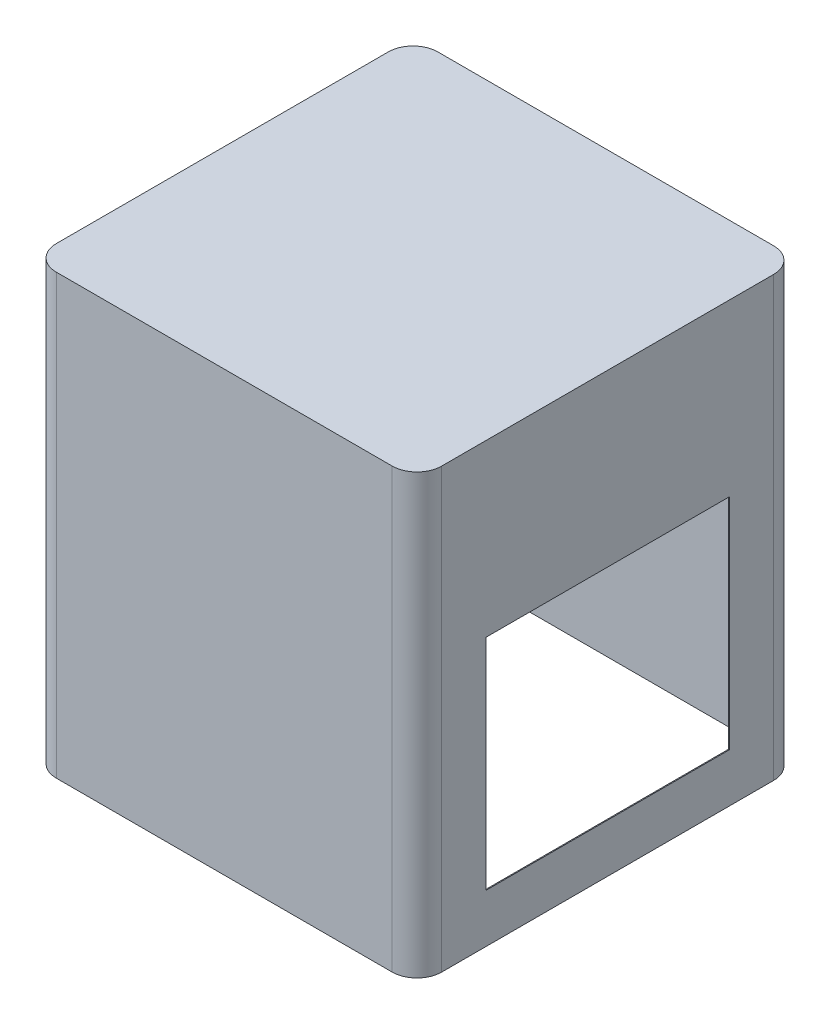
ISO-10303-21;
HEADER;
FILE_DESCRIPTION(('STEP AP214'),'2;1');
FILE_NAME('part.step','',(''),(''),'','','');
FILE_SCHEMA(('AUTOMOTIVE_DESIGN { 1 0 10303 214 1 1 1 1 }'));
ENDSEC;
DATA;
#1=APPLICATION_CONTEXT('core data for automotive mechanical design processes');
#2=APPLICATION_PROTOCOL_DEFINITION('international standard','automotive_design',2000,#1);
#3=PRODUCT_CONTEXT('',#1,'mechanical');
#4=PRODUCT('Part','Part','',(#3));
#5=PRODUCT_RELATED_PRODUCT_CATEGORY('part','',(#4));
#6=PRODUCT_DEFINITION_FORMATION('','',#4);
#7=PRODUCT_DEFINITION_CONTEXT('part definition',#1,'design');
#8=PRODUCT_DEFINITION('design','',#6,#7);
#9=PRODUCT_DEFINITION_SHAPE('','',#8);
#10=(LENGTH_UNIT() NAMED_UNIT(*) SI_UNIT(.MILLI.,.METRE.));
#11=(NAMED_UNIT(*) PLANE_ANGLE_UNIT() SI_UNIT($,.RADIAN.));
#12=(NAMED_UNIT(*) SI_UNIT($,.STERADIAN.) SOLID_ANGLE_UNIT());
#13=UNCERTAINTY_MEASURE_WITH_UNIT(LENGTH_MEASURE(1.E-05),#10,'distance_accuracy_value','');
#14=(GEOMETRIC_REPRESENTATION_CONTEXT(3) GLOBAL_UNCERTAINTY_ASSIGNED_CONTEXT((#13)) GLOBAL_UNIT_ASSIGNED_CONTEXT((#10,
#11,#12)) REPRESENTATION_CONTEXT('',''));
#15=CARTESIAN_POINT('',(0.,0.,0.));
#16=DIRECTION('',(0.,0.,1.));
#17=DIRECTION('',(1.,0.,0.));
#18=AXIS2_PLACEMENT_3D('',#15,#16,#17);
#19=CARTESIAN_POINT('',(197.85242,450.,-195.85242));
#20=DIRECTION('',(-1.,0.,0.));
#21=DIRECTION('',(0.,0.,1.));
#22=AXIS2_PLACEMENT_3D('',#19,#20,#21);
#23=PLANE('',#22);
#24=DIRECTION('',(0.,0.,-1.));
#25=VECTOR('',#24,1.);
#26=CARTESIAN_POINT('',(197.85242,0.,-195.85242));
#27=LINE('',#26,#25);
#28=CARTESIAN_POINT('',(197.85242,0.,170.45242));
#29=VERTEX_POINT('',#28);
#30=CARTESIAN_POINT('',(197.85242,0.,-170.45242));
#31=VERTEX_POINT('',#30);
#32=EDGE_CURVE('E300',#29,#31,#27,.T.);
#33=ORIENTED_EDGE('',*,*,#32,.T.);
#34=DIRECTION('',(0.,-1.,0.));
#35=VECTOR('',#34,1.);
#36=CARTESIAN_POINT('',(197.85242,450.,-170.45242));
#37=LINE('',#36,#35);
#38=CARTESIAN_POINT('',(197.85242,450.,-170.45242));
#39=VERTEX_POINT('',#38);
#40=EDGE_CURVE('E323',#31,#39,#37,.F.);
#41=ORIENTED_EDGE('',*,*,#40,.T.);
#42=DIRECTION('',(0.,0.,-1.));
#43=VECTOR('',#42,1.);
#44=CARTESIAN_POINT('',(197.85242,450.,-195.85242));
#45=LINE('',#44,#43);
#46=CARTESIAN_POINT('',(197.85242,450.,170.45242));
#47=VERTEX_POINT('',#46);
#48=EDGE_CURVE('E287',#47,#39,#45,.T.);
#49=ORIENTED_EDGE('',*,*,#48,.F.);
#50=DIRECTION('',(0.,-1.,0.));
#51=VECTOR('',#50,1.);
#52=CARTESIAN_POINT('',(197.85242,450.,170.45242));
#53=LINE('',#52,#51);
#54=EDGE_CURVE('E320',#47,#29,#53,.T.);
#55=ORIENTED_EDGE('',*,*,#54,.T.);
#56=EDGE_LOOP('',(#33,#41,#49,#55));
#57=FACE_BOUND('',#56,.T.);
#58=DIRECTION('',(0.,0.,-1.));
#59=VECTOR('',#58,1.);
#60=CARTESIAN_POINT('',(197.85242,275.,-125.));
#61=LINE('',#60,#59);
#62=CARTESIAN_POINT('',(197.85242,275.,125.));
#63=VERTEX_POINT('',#62);
#64=CARTESIAN_POINT('',(197.85242,275.,-125.));
#65=VERTEX_POINT('',#64);
#66=EDGE_CURVE('E211',#63,#65,#61,.T.);
#67=ORIENTED_EDGE('',*,*,#66,.T.);
#68=DIRECTION('',(0.,-1.,0.));
#69=VECTOR('',#68,1.);
#70=CARTESIAN_POINT('',(197.85242,275.,-125.));
#71=LINE('',#70,#69);
#72=CARTESIAN_POINT('',(197.85242,50.,-125.));
#73=VERTEX_POINT('',#72);
#74=EDGE_CURVE('E214',#65,#73,#71,.T.);
#75=ORIENTED_EDGE('',*,*,#74,.T.);
#76=DIRECTION('',(0.,0.,1.));
#77=VECTOR('',#76,1.);
#78=CARTESIAN_POINT('',(197.85242,50.,-125.));
#79=LINE('',#78,#77);
#80=CARTESIAN_POINT('',(197.85242,50.,125.));
#81=VERTEX_POINT('',#80);
#82=EDGE_CURVE('E58',#73,#81,#79,.T.);
#83=ORIENTED_EDGE('',*,*,#82,.T.);
#84=DIRECTION('',(0.,1.,0.));
#85=VECTOR('',#84,1.);
#86=CARTESIAN_POINT('',(197.85242,275.,125.));
#87=LINE('',#86,#85);
#88=EDGE_CURVE('E188',#81,#63,#87,.T.);
#89=ORIENTED_EDGE('',*,*,#88,.T.);
#90=EDGE_LOOP('',(#67,#75,#83,#89));
#91=FACE_BOUND('',#90,.T.);
#92=ADVANCED_FACE('F40',(#57,#91),#23,.F.);
#93=CARTESIAN_POINT('',(196.89992,450.,-195.85242));
#94=DIRECTION('',(-1.,0.,0.));
#95=DIRECTION('',(0.,0.,1.));
#96=AXIS2_PLACEMENT_3D('',#93,#94,#95);
#97=PLANE('',#96);
#98=DIRECTION('',(0.,0.,-1.));
#99=VECTOR('',#98,1.);
#100=CARTESIAN_POINT('',(196.89992,0.,0.));
#101=LINE('',#100,#99);
#102=CARTESIAN_POINT('',(196.89992,0.,170.45242));
#103=VERTEX_POINT('',#102);
#104=CARTESIAN_POINT('',(196.89992,0.,-170.45242));
#105=VERTEX_POINT('',#104);
#106=EDGE_CURVE('E271',#103,#105,#101,.T.);
#107=ORIENTED_EDGE('',*,*,#106,.F.);
#108=DIRECTION('',(0.,1.,0.));
#109=VECTOR('',#108,1.);
#110=CARTESIAN_POINT('',(196.89992,450.,170.45242));
#111=LINE('',#110,#109);
#112=CARTESIAN_POINT('',(196.89992,449.0475,170.45242));
#113=VERTEX_POINT('',#112);
#114=EDGE_CURVE('E250',#113,#103,#111,.F.);
#115=ORIENTED_EDGE('',*,*,#114,.F.);
#116=DIRECTION('',(0.,0.,-1.));
#117=VECTOR('',#116,1.);
#118=CARTESIAN_POINT('',(196.89992,449.0475,0.));
#119=LINE('',#118,#117);
#120=CARTESIAN_POINT('',(196.89992,449.0475,-170.45242));
#121=VERTEX_POINT('',#120);
#122=EDGE_CURVE('E228',#113,#121,#119,.T.);
#123=ORIENTED_EDGE('',*,*,#122,.T.);
#124=DIRECTION('',(0.,1.,0.));
#125=VECTOR('',#124,1.);
#126=CARTESIAN_POINT('',(196.89992,450.,-170.45242));
#127=LINE('',#126,#125);
#128=EDGE_CURVE('E244',#105,#121,#127,.T.);
#129=ORIENTED_EDGE('',*,*,#128,.F.);
#130=EDGE_LOOP('',(#107,#115,#123,#129));
#131=FACE_BOUND('',#130,.T.);
#132=DIRECTION('',(0.,-1.,0.));
#133=VECTOR('',#132,1.);
#134=CARTESIAN_POINT('',(196.89992,275.,-125.));
#135=LINE('',#134,#133);
#136=CARTESIAN_POINT('',(196.89992,275.,-125.));
#137=VERTEX_POINT('',#136);
#138=CARTESIAN_POINT('',(196.89992,50.,-125.));
#139=VERTEX_POINT('',#138);
#140=EDGE_CURVE('E191',#137,#139,#135,.T.);
#141=ORIENTED_EDGE('',*,*,#140,.F.);
#142=DIRECTION('',(0.,0.,-1.));
#143=VECTOR('',#142,1.);
#144=CARTESIAN_POINT('',(196.89992,275.,-125.));
#145=LINE('',#144,#143);
#146=CARTESIAN_POINT('',(196.89992,275.,125.));
#147=VERTEX_POINT('',#146);
#148=EDGE_CURVE('E66',#147,#137,#145,.T.);
#149=ORIENTED_EDGE('',*,*,#148,.F.);
#150=DIRECTION('',(0.,1.,0.));
#151=VECTOR('',#150,1.);
#152=CARTESIAN_POINT('',(196.89992,275.,125.));
#153=LINE('',#152,#151);
#154=CARTESIAN_POINT('',(196.89992,50.,125.));
#155=VERTEX_POINT('',#154);
#156=EDGE_CURVE('E199',#155,#147,#153,.T.);
#157=ORIENTED_EDGE('',*,*,#156,.F.);
#158=DIRECTION('',(0.,0.,1.));
#159=VECTOR('',#158,1.);
#160=CARTESIAN_POINT('',(196.89992,50.,-125.));
#161=LINE('',#160,#159);
#162=EDGE_CURVE('E182',#139,#155,#161,.T.);
#163=ORIENTED_EDGE('',*,*,#162,.F.);
#164=EDGE_LOOP('',(#141,#149,#157,#163));
#165=FACE_BOUND('',#164,.T.);
#166=ADVANCED_FACE('F197',(#131,#165),#97,.T.);
#167=CARTESIAN_POINT('',(0.,0.,0.));
#168=DIRECTION('',(0.,-1.,0.));
#169=DIRECTION('',(0.,0.,-1.));
#170=AXIS2_PLACEMENT_3D('',#167,#168,#169);
#171=PLANE('',#170);
#172=DIRECTION('',(-1.,0.,0.));
#173=VECTOR('',#172,1.);
#174=CARTESIAN_POINT('',(197.85242,0.,-195.85242));
#175=LINE('',#174,#173);
#176=CARTESIAN_POINT('',(172.45242,0.,-195.85242));
#177=VERTEX_POINT('',#176);
#178=CARTESIAN_POINT('',(-172.45242,0.,-195.85242));
#179=VERTEX_POINT('',#178);
#180=EDGE_CURVE('E284',#177,#179,#175,.T.);
#181=ORIENTED_EDGE('',*,*,#180,.F.);
#182=CARTESIAN_POINT('',(172.45242,0.,-170.45242));
#183=DIRECTION('',(0.,-1.,0.));
#184=DIRECTION('',(0.,0.,-1.));
#185=AXIS2_PLACEMENT_3D('',#182,#183,#184);
#186=CIRCLE('',#185,25.4);
#187=EDGE_CURVE('E318',#177,#31,#186,.T.);
#188=ORIENTED_EDGE('',*,*,#187,.T.);
#189=ORIENTED_EDGE('',*,*,#32,.F.);
#190=CARTESIAN_POINT('',(172.45242,0.,170.45242));
#191=DIRECTION('',(0.,-1.,0.));
#192=DIRECTION('',(0.,0.,-1.));
#193=AXIS2_PLACEMENT_3D('',#190,#191,#192);
#194=CIRCLE('',#193,25.4);
#195=CARTESIAN_POINT('',(172.45242,0.,195.85242));
#196=VERTEX_POINT('',#195);
#197=EDGE_CURVE('E312',#29,#196,#194,.T.);
#198=ORIENTED_EDGE('',*,*,#197,.T.);
#199=DIRECTION('',(1.,0.,0.));
#200=VECTOR('',#199,1.);
#201=CARTESIAN_POINT('',(197.85242,0.,195.85242));
#202=LINE('',#201,#200);
#203=CARTESIAN_POINT('',(-172.45242,0.,195.85242));
#204=VERTEX_POINT('',#203);
#205=EDGE_CURVE('E297',#204,#196,#202,.T.);
#206=ORIENTED_EDGE('',*,*,#205,.F.);
#207=CARTESIAN_POINT('',(-172.45242,0.,170.45242));
#208=DIRECTION('',(0.,-1.,0.));
#209=DIRECTION('',(0.,0.,-1.));
#210=AXIS2_PLACEMENT_3D('',#207,#208,#209);
#211=CIRCLE('',#210,25.4);
#212=CARTESIAN_POINT('',(-197.85242,0.,170.45242));
#213=VERTEX_POINT('',#212);
#214=EDGE_CURVE('E314',#204,#213,#211,.T.);
#215=ORIENTED_EDGE('',*,*,#214,.T.);
#216=DIRECTION('',(0.,0.,1.));
#217=VECTOR('',#216,1.);
#218=CARTESIAN_POINT('',(-197.85242,0.,-195.85242));
#219=LINE('',#218,#217);
#220=CARTESIAN_POINT('',(-197.85242,0.,-170.45242));
#221=VERTEX_POINT('',#220);
#222=EDGE_CURVE('E248',#221,#213,#219,.T.);
#223=ORIENTED_EDGE('',*,*,#222,.F.);
#224=CARTESIAN_POINT('',(-172.45242,0.,-170.45242));
#225=DIRECTION('',(0.,-1.,0.));
#226=DIRECTION('',(0.,0.,-1.));
#227=AXIS2_PLACEMENT_3D('',#224,#225,#226);
#228=CIRCLE('',#227,25.4);
#229=EDGE_CURVE('E316',#221,#179,#228,.T.);
#230=ORIENTED_EDGE('',*,*,#229,.T.);
#231=EDGE_LOOP('',(#181,#188,#189,#198,#206,#215,#223,#230));
#232=FACE_BOUND('',#231,.T.);
#233=CARTESIAN_POINT('',(172.45242,0.,-170.45242));
#234=DIRECTION('',(0.,-1.,0.));
#235=DIRECTION('',(0.,0.,-1.));
#236=AXIS2_PLACEMENT_3D('',#233,#234,#235);
#237=CIRCLE('',#236,24.4475);
#238=CARTESIAN_POINT('',(172.45242,0.,-194.89992));
#239=VERTEX_POINT('',#238);
#240=EDGE_CURVE('E252',#239,#105,#237,.T.);
#241=ORIENTED_EDGE('',*,*,#240,.F.);
#242=DIRECTION('',(-1.,0.,0.));
#243=VECTOR('',#242,1.);
#244=CARTESIAN_POINT('',(0.,0.,-194.89992));
#245=LINE('',#244,#243);
#246=CARTESIAN_POINT('',(-172.45242,0.,-194.89992));
#247=VERTEX_POINT('',#246);
#248=EDGE_CURVE('E219',#239,#247,#245,.T.);
#249=ORIENTED_EDGE('',*,*,#248,.T.);
#250=CARTESIAN_POINT('',(-172.45242,0.,-170.45242));
#251=DIRECTION('',(0.,-1.,0.));
#252=DIRECTION('',(0.,0.,-1.));
#253=AXIS2_PLACEMENT_3D('',#250,#251,#252);
#254=CIRCLE('',#253,24.4475);
#255=CARTESIAN_POINT('',(-196.89992,0.,-170.45242));
#256=VERTEX_POINT('',#255);
#257=EDGE_CURVE('E265',#256,#247,#254,.T.);
#258=ORIENTED_EDGE('',*,*,#257,.F.);
#259=DIRECTION('',(0.,0.,1.));
#260=VECTOR('',#259,1.);
#261=CARTESIAN_POINT('',(-196.89992,0.,0.));
#262=LINE('',#261,#260);
#263=CARTESIAN_POINT('',(-196.89992,0.,170.45242));
#264=VERTEX_POINT('',#263);
#265=EDGE_CURVE('E260',#256,#264,#262,.T.);
#266=ORIENTED_EDGE('',*,*,#265,.T.);
#267=CARTESIAN_POINT('',(-172.45242,0.,170.45242));
#268=DIRECTION('',(0.,-1.,0.));
#269=DIRECTION('',(0.,0.,-1.));
#270=AXIS2_PLACEMENT_3D('',#267,#268,#269);
#271=CIRCLE('',#270,24.4475);
#272=CARTESIAN_POINT('',(-172.45242,0.,194.89992));
#273=VERTEX_POINT('',#272);
#274=EDGE_CURVE('E267',#273,#264,#271,.T.);
#275=ORIENTED_EDGE('',*,*,#274,.F.);
#276=DIRECTION('',(1.,0.,0.));
#277=VECTOR('',#276,1.);
#278=CARTESIAN_POINT('',(0.,0.,194.89992));
#279=LINE('',#278,#277);
#280=CARTESIAN_POINT('',(172.45242,0.,194.89992));
#281=VERTEX_POINT('',#280);
#282=EDGE_CURVE('E264',#273,#281,#279,.T.);
#283=ORIENTED_EDGE('',*,*,#282,.T.);
#284=CARTESIAN_POINT('',(172.45242,0.,170.45242));
#285=DIRECTION('',(0.,-1.,0.));
#286=DIRECTION('',(0.,0.,-1.));
#287=AXIS2_PLACEMENT_3D('',#284,#285,#286);
#288=CIRCLE('',#287,24.4475);
#289=EDGE_CURVE('E258',#103,#281,#288,.T.);
#290=ORIENTED_EDGE('',*,*,#289,.F.);
#291=ORIENTED_EDGE('',*,*,#106,.T.);
#292=EDGE_LOOP('',(#241,#249,#258,#266,#275,#283,#290,#291));
#293=FACE_BOUND('',#292,.T.);
#294=ADVANCED_FACE('F357',(#232,#293),#171,.T.);
#295=CARTESIAN_POINT('',(-197.85242,450.,-195.85242));
#296=DIRECTION('',(1.,0.,0.));
#297=DIRECTION('',(0.,0.,-1.));
#298=AXIS2_PLACEMENT_3D('',#295,#296,#297);
#299=PLANE('',#298);
#300=DIRECTION('',(0.,0.,1.));
#301=VECTOR('',#300,1.);
#302=CARTESIAN_POINT('',(-197.85242,450.,-195.85242));
#303=LINE('',#302,#301);
#304=CARTESIAN_POINT('',(-197.85242,450.,-170.45242));
#305=VERTEX_POINT('',#304);
#306=CARTESIAN_POINT('',(-197.85242,450.,170.45242));
#307=VERTEX_POINT('',#306);
#308=EDGE_CURVE('E280',#305,#307,#303,.T.);
#309=ORIENTED_EDGE('',*,*,#308,.F.);
#310=DIRECTION('',(0.,-1.,0.));
#311=VECTOR('',#310,1.);
#312=CARTESIAN_POINT('',(-197.85242,450.,-170.45242));
#313=LINE('',#312,#311);
#314=EDGE_CURVE('E336',#305,#221,#313,.T.);
#315=ORIENTED_EDGE('',*,*,#314,.T.);
#316=ORIENTED_EDGE('',*,*,#222,.T.);
#317=DIRECTION('',(0.,-1.,0.));
#318=VECTOR('',#317,1.);
#319=CARTESIAN_POINT('',(-197.85242,450.,170.45242));
#320=LINE('',#319,#318);
#321=EDGE_CURVE('E333',#213,#307,#320,.F.);
#322=ORIENTED_EDGE('',*,*,#321,.T.);
#323=EDGE_LOOP('',(#309,#315,#316,#322));
#324=FACE_BOUND('',#323,.T.);
#325=ADVANCED_FACE('F374',(#324),#299,.F.);
#326=CARTESIAN_POINT('',(197.85242,450.,195.85242));
#327=DIRECTION('',(0.,0.,-1.));
#328=DIRECTION('',(-1.,0.,0.));
#329=AXIS2_PLACEMENT_3D('',#326,#327,#328);
#330=PLANE('',#329);
#331=DIRECTION('',(1.,0.,0.));
#332=VECTOR('',#331,1.);
#333=CARTESIAN_POINT('',(197.85242,450.,195.85242));
#334=LINE('',#333,#332);
#335=CARTESIAN_POINT('',(-172.45242,450.,195.85242));
#336=VERTEX_POINT('',#335);
#337=CARTESIAN_POINT('',(172.45242,450.,195.85242));
#338=VERTEX_POINT('',#337);
#339=EDGE_CURVE('E283',#336,#338,#334,.T.);
#340=ORIENTED_EDGE('',*,*,#339,.F.);
#341=DIRECTION('',(0.,-1.,0.));
#342=VECTOR('',#341,1.);
#343=CARTESIAN_POINT('',(-172.45242,450.,195.85242));
#344=LINE('',#343,#342);
#345=EDGE_CURVE('E11',#336,#204,#344,.T.);
#346=ORIENTED_EDGE('',*,*,#345,.T.);
#347=ORIENTED_EDGE('',*,*,#205,.T.);
#348=DIRECTION('',(0.,-1.,0.));
#349=VECTOR('',#348,1.);
#350=CARTESIAN_POINT('',(172.45242,450.,195.85242));
#351=LINE('',#350,#349);
#352=EDGE_CURVE('E49',#196,#338,#351,.F.);
#353=ORIENTED_EDGE('',*,*,#352,.T.);
#354=EDGE_LOOP('',(#340,#346,#347,#353));
#355=FACE_BOUND('',#354,.T.);
#356=ADVANCED_FACE('F341',(#355),#330,.F.);
#357=CARTESIAN_POINT('',(197.85242,450.,-195.85242));
#358=DIRECTION('',(0.,0.,1.));
#359=DIRECTION('',(1.,0.,0.));
#360=AXIS2_PLACEMENT_3D('',#357,#358,#359);
#361=PLANE('',#360);
#362=DIRECTION('',(-1.,0.,0.));
#363=VECTOR('',#362,1.);
#364=CARTESIAN_POINT('',(197.85242,450.,-195.85242));
#365=LINE('',#364,#363);
#366=CARTESIAN_POINT('',(172.45242,450.,-195.85242));
#367=VERTEX_POINT('',#366);
#368=CARTESIAN_POINT('',(-172.45242,450.,-195.85242));
#369=VERTEX_POINT('',#368);
#370=EDGE_CURVE('E290',#367,#369,#365,.T.);
#371=ORIENTED_EDGE('',*,*,#370,.F.);
#372=DIRECTION('',(0.,-1.,0.));
#373=VECTOR('',#372,1.);
#374=CARTESIAN_POINT('',(172.45242,450.,-195.85242));
#375=LINE('',#374,#373);
#376=EDGE_CURVE('E308',#367,#177,#375,.T.);
#377=ORIENTED_EDGE('',*,*,#376,.T.);
#378=ORIENTED_EDGE('',*,*,#180,.T.);
#379=DIRECTION('',(0.,-1.,0.));
#380=VECTOR('',#379,1.);
#381=CARTESIAN_POINT('',(-172.45242,450.,-195.85242));
#382=LINE('',#381,#380);
#383=EDGE_CURVE('E293',#179,#369,#382,.F.);
#384=ORIENTED_EDGE('',*,*,#383,.T.);
#385=EDGE_LOOP('',(#371,#377,#378,#384));
#386=FACE_BOUND('',#385,.T.);
#387=ADVANCED_FACE('F365',(#386),#361,.F.);
#388=CARTESIAN_POINT('',(0.,450.,0.));
#389=DIRECTION('',(0.,-1.,0.));
#390=DIRECTION('',(0.,0.,-1.));
#391=AXIS2_PLACEMENT_3D('',#388,#389,#390);
#392=PLANE('',#391);
#393=ORIENTED_EDGE('',*,*,#48,.T.);
#394=CARTESIAN_POINT('',(172.45242,450.,-170.45242));
#395=DIRECTION('',(0.,-1.,0.));
#396=DIRECTION('',(0.,0.,-1.));
#397=AXIS2_PLACEMENT_3D('',#394,#395,#396);
#398=CIRCLE('',#397,25.4);
#399=EDGE_CURVE('E331',#39,#367,#398,.F.);
#400=ORIENTED_EDGE('',*,*,#399,.T.);
#401=ORIENTED_EDGE('',*,*,#370,.T.);
#402=CARTESIAN_POINT('',(-172.45242,450.,-170.45242));
#403=DIRECTION('',(0.,-1.,0.));
#404=DIRECTION('',(0.,0.,-1.));
#405=AXIS2_PLACEMENT_3D('',#402,#403,#404);
#406=CIRCLE('',#405,25.4);
#407=EDGE_CURVE('E329',#369,#305,#406,.F.);
#408=ORIENTED_EDGE('',*,*,#407,.T.);
#409=ORIENTED_EDGE('',*,*,#308,.T.);
#410=CARTESIAN_POINT('',(-172.45242,450.,170.45242));
#411=DIRECTION('',(0.,-1.,0.));
#412=DIRECTION('',(0.,0.,-1.));
#413=AXIS2_PLACEMENT_3D('',#410,#411,#412);
#414=CIRCLE('',#413,25.4);
#415=EDGE_CURVE('E327',#307,#336,#414,.F.);
#416=ORIENTED_EDGE('',*,*,#415,.T.);
#417=ORIENTED_EDGE('',*,*,#339,.T.);
#418=CARTESIAN_POINT('',(172.45242,450.,170.45242));
#419=DIRECTION('',(0.,-1.,0.));
#420=DIRECTION('',(0.,0.,-1.));
#421=AXIS2_PLACEMENT_3D('',#418,#419,#420);
#422=CIRCLE('',#421,25.4);
#423=EDGE_CURVE('E325',#338,#47,#422,.F.);
#424=ORIENTED_EDGE('',*,*,#423,.T.);
#425=EDGE_LOOP('',(#393,#400,#401,#408,#409,#416,#417,#424));
#426=FACE_BOUND('',#425,.T.);
#427=ADVANCED_FACE('F347',(#426),#392,.F.);
#428=CARTESIAN_POINT('',(172.45242,450.,-170.45242));
#429=DIRECTION('',(0.,-1.,0.));
#430=DIRECTION('',(0.,0.,-1.));
#431=AXIS2_PLACEMENT_3D('',#428,#429,#430);
#432=CYLINDRICAL_SURFACE('',#431,25.4);
#433=ORIENTED_EDGE('',*,*,#399,.F.);
#434=ORIENTED_EDGE('',*,*,#40,.F.);
#435=ORIENTED_EDGE('',*,*,#187,.F.);
#436=ORIENTED_EDGE('',*,*,#376,.F.);
#437=EDGE_LOOP('',(#433,#434,#435,#436));
#438=FACE_BOUND('',#437,.T.);
#439=ADVANCED_FACE('F362',(#438),#432,.T.);
#440=CARTESIAN_POINT('',(-172.45242,450.,-170.45242));
#441=DIRECTION('',(0.,-1.,0.));
#442=DIRECTION('',(0.,0.,-1.));
#443=AXIS2_PLACEMENT_3D('',#440,#441,#442);
#444=CYLINDRICAL_SURFACE('',#443,25.4);
#445=ORIENTED_EDGE('',*,*,#407,.F.);
#446=ORIENTED_EDGE('',*,*,#383,.F.);
#447=ORIENTED_EDGE('',*,*,#229,.F.);
#448=ORIENTED_EDGE('',*,*,#314,.F.);
#449=EDGE_LOOP('',(#445,#446,#447,#448));
#450=FACE_BOUND('',#449,.T.);
#451=ADVANCED_FACE('F371',(#450),#444,.T.);
#452=CARTESIAN_POINT('',(-172.45242,450.,170.45242));
#453=DIRECTION('',(0.,-1.,0.));
#454=DIRECTION('',(0.,0.,-1.));
#455=AXIS2_PLACEMENT_3D('',#452,#453,#454);
#456=CYLINDRICAL_SURFACE('',#455,25.4);
#457=ORIENTED_EDGE('',*,*,#415,.F.);
#458=ORIENTED_EDGE('',*,*,#321,.F.);
#459=ORIENTED_EDGE('',*,*,#214,.F.);
#460=ORIENTED_EDGE('',*,*,#345,.F.);
#461=EDGE_LOOP('',(#457,#458,#459,#460));
#462=FACE_BOUND('',#461,.T.);
#463=ADVANCED_FACE('F377',(#462),#456,.T.);
#464=CARTESIAN_POINT('',(172.45242,450.,170.45242));
#465=DIRECTION('',(0.,-1.,0.));
#466=DIRECTION('',(0.,0.,-1.));
#467=AXIS2_PLACEMENT_3D('',#464,#465,#466);
#468=CYLINDRICAL_SURFACE('',#467,25.4);
#469=ORIENTED_EDGE('',*,*,#423,.F.);
#470=ORIENTED_EDGE('',*,*,#352,.F.);
#471=ORIENTED_EDGE('',*,*,#197,.F.);
#472=ORIENTED_EDGE('',*,*,#54,.F.);
#473=EDGE_LOOP('',(#469,#470,#471,#472));
#474=FACE_BOUND('',#473,.T.);
#475=ADVANCED_FACE('F42',(#474),#468,.T.);
#476=CARTESIAN_POINT('',(-196.89992,450.,-195.85242));
#477=DIRECTION('',(1.,0.,0.));
#478=DIRECTION('',(0.,0.,-1.));
#479=AXIS2_PLACEMENT_3D('',#476,#477,#478);
#480=PLANE('',#479);
#481=DIRECTION('',(0.,0.,1.));
#482=VECTOR('',#481,1.);
#483=CARTESIAN_POINT('',(-196.89992,449.0475,0.));
#484=LINE('',#483,#482);
#485=CARTESIAN_POINT('',(-196.89992,449.0475,-170.45242));
#486=VERTEX_POINT('',#485);
#487=CARTESIAN_POINT('',(-196.89992,449.0475,170.45242));
#488=VERTEX_POINT('',#487);
#489=EDGE_CURVE('E215',#486,#488,#484,.T.);
#490=ORIENTED_EDGE('',*,*,#489,.T.);
#491=DIRECTION('',(0.,1.,0.));
#492=VECTOR('',#491,1.);
#493=CARTESIAN_POINT('',(-196.89992,450.,170.45242));
#494=LINE('',#493,#492);
#495=EDGE_CURVE('E224',#264,#488,#494,.T.);
#496=ORIENTED_EDGE('',*,*,#495,.F.);
#497=ORIENTED_EDGE('',*,*,#265,.F.);
#498=DIRECTION('',(0.,1.,0.));
#499=VECTOR('',#498,1.);
#500=CARTESIAN_POINT('',(-196.89992,450.,-170.45242));
#501=LINE('',#500,#499);
#502=EDGE_CURVE('E220',#486,#256,#501,.F.);
#503=ORIENTED_EDGE('',*,*,#502,.F.);
#504=EDGE_LOOP('',(#490,#496,#497,#503));
#505=FACE_BOUND('',#504,.T.);
#506=ADVANCED_FACE('F382',(#505),#480,.T.);
#507=CARTESIAN_POINT('',(197.85242,450.,194.89992));
#508=DIRECTION('',(0.,0.,-1.));
#509=DIRECTION('',(-1.,0.,0.));
#510=AXIS2_PLACEMENT_3D('',#507,#508,#509);
#511=PLANE('',#510);
#512=DIRECTION('',(1.,0.,0.));
#513=VECTOR('',#512,1.);
#514=CARTESIAN_POINT('',(0.,449.0475,194.89992));
#515=LINE('',#514,#513);
#516=CARTESIAN_POINT('',(-172.45242,449.0475,194.89992));
#517=VERTEX_POINT('',#516);
#518=CARTESIAN_POINT('',(172.45242,449.0475,194.89992));
#519=VERTEX_POINT('',#518);
#520=EDGE_CURVE('E218',#517,#519,#515,.T.);
#521=ORIENTED_EDGE('',*,*,#520,.T.);
#522=DIRECTION('',(0.,1.,0.));
#523=VECTOR('',#522,1.);
#524=CARTESIAN_POINT('',(172.45242,450.,194.89992));
#525=LINE('',#524,#523);
#526=EDGE_CURVE('E223',#281,#519,#525,.T.);
#527=ORIENTED_EDGE('',*,*,#526,.F.);
#528=ORIENTED_EDGE('',*,*,#282,.F.);
#529=DIRECTION('',(0.,1.,0.));
#530=VECTOR('',#529,1.);
#531=CARTESIAN_POINT('',(-172.45242,450.,194.89992));
#532=LINE('',#531,#530);
#533=EDGE_CURVE('E245',#517,#273,#532,.F.);
#534=ORIENTED_EDGE('',*,*,#533,.F.);
#535=EDGE_LOOP('',(#521,#527,#528,#534));
#536=FACE_BOUND('',#535,.T.);
#537=ADVANCED_FACE('F440',(#536),#511,.T.);
#538=CARTESIAN_POINT('',(197.85242,450.,-194.89992));
#539=DIRECTION('',(0.,0.,1.));
#540=DIRECTION('',(1.,0.,0.));
#541=AXIS2_PLACEMENT_3D('',#538,#539,#540);
#542=PLANE('',#541);
#543=DIRECTION('',(-1.,0.,0.));
#544=VECTOR('',#543,1.);
#545=CARTESIAN_POINT('',(0.,449.0475,-194.89992));
#546=LINE('',#545,#544);
#547=CARTESIAN_POINT('',(172.45242,449.0475,-194.89992));
#548=VERTEX_POINT('',#547);
#549=CARTESIAN_POINT('',(-172.45242,449.0475,-194.89992));
#550=VERTEX_POINT('',#549);
#551=EDGE_CURVE('E231',#548,#550,#546,.T.);
#552=ORIENTED_EDGE('',*,*,#551,.T.);
#553=DIRECTION('',(0.,1.,0.));
#554=VECTOR('',#553,1.);
#555=CARTESIAN_POINT('',(-172.45242,450.,-194.89992));
#556=LINE('',#555,#554);
#557=EDGE_CURVE('E236',#247,#550,#556,.T.);
#558=ORIENTED_EDGE('',*,*,#557,.F.);
#559=ORIENTED_EDGE('',*,*,#248,.F.);
#560=DIRECTION('',(0.,1.,0.));
#561=VECTOR('',#560,1.);
#562=CARTESIAN_POINT('',(172.45242,450.,-194.89992));
#563=LINE('',#562,#561);
#564=EDGE_CURVE('E255',#548,#239,#563,.F.);
#565=ORIENTED_EDGE('',*,*,#564,.F.);
#566=EDGE_LOOP('',(#552,#558,#559,#565));
#567=FACE_BOUND('',#566,.T.);
#568=ADVANCED_FACE('F437',(#567),#542,.T.);
#569=CARTESIAN_POINT('',(0.,449.0475,0.));
#570=DIRECTION('',(0.,-1.,0.));
#571=DIRECTION('',(0.,0.,-1.));
#572=AXIS2_PLACEMENT_3D('',#569,#570,#571);
#573=PLANE('',#572);
#574=ORIENTED_EDGE('',*,*,#122,.F.);
#575=CARTESIAN_POINT('',(172.45242,449.0475,170.45242));
#576=DIRECTION('',(0.,-1.,0.));
#577=DIRECTION('',(0.,0.,-1.));
#578=AXIS2_PLACEMENT_3D('',#575,#576,#577);
#579=CIRCLE('',#578,24.4475);
#580=EDGE_CURVE('E240',#519,#113,#579,.F.);
#581=ORIENTED_EDGE('',*,*,#580,.F.);
#582=ORIENTED_EDGE('',*,*,#520,.F.);
#583=CARTESIAN_POINT('',(-172.45242,449.0475,170.45242));
#584=DIRECTION('',(0.,-1.,0.));
#585=DIRECTION('',(0.,0.,-1.));
#586=AXIS2_PLACEMENT_3D('',#583,#584,#585);
#587=CIRCLE('',#586,24.4475);
#588=EDGE_CURVE('E238',#488,#517,#587,.F.);
#589=ORIENTED_EDGE('',*,*,#588,.F.);
#590=ORIENTED_EDGE('',*,*,#489,.F.);
#591=CARTESIAN_POINT('',(-172.45242,449.0475,-170.45242));
#592=DIRECTION('',(0.,-1.,0.));
#593=DIRECTION('',(0.,0.,-1.));
#594=AXIS2_PLACEMENT_3D('',#591,#592,#593);
#595=CIRCLE('',#594,24.4475);
#596=EDGE_CURVE('E233',#550,#486,#595,.F.);
#597=ORIENTED_EDGE('',*,*,#596,.F.);
#598=ORIENTED_EDGE('',*,*,#551,.F.);
#599=CARTESIAN_POINT('',(172.45242,449.0475,-170.45242));
#600=DIRECTION('',(0.,-1.,0.));
#601=DIRECTION('',(0.,0.,-1.));
#602=AXIS2_PLACEMENT_3D('',#599,#600,#601);
#603=CIRCLE('',#602,24.4475);
#604=EDGE_CURVE('E227',#121,#548,#603,.F.);
#605=ORIENTED_EDGE('',*,*,#604,.F.);
#606=EDGE_LOOP('',(#574,#581,#582,#589,#590,#597,#598,#605));
#607=FACE_BOUND('',#606,.T.);
#608=ADVANCED_FACE('F439',(#607),#573,.T.);
#609=CARTESIAN_POINT('',(172.45242,450.,-170.45242));
#610=DIRECTION('',(0.,-1.,0.));
#611=DIRECTION('',(0.,0.,-1.));
#612=AXIS2_PLACEMENT_3D('',#609,#610,#611);
#613=CYLINDRICAL_SURFACE('',#612,24.4475);
#614=ORIENTED_EDGE('',*,*,#604,.T.);
#615=ORIENTED_EDGE('',*,*,#564,.T.);
#616=ORIENTED_EDGE('',*,*,#240,.T.);
#617=ORIENTED_EDGE('',*,*,#128,.T.);
#618=EDGE_LOOP('',(#614,#615,#616,#617));
#619=FACE_BOUND('',#618,.T.);
#620=ADVANCED_FACE('F470',(#619),#613,.F.);
#621=CARTESIAN_POINT('',(-172.45242,450.,-170.45242));
#622=DIRECTION('',(0.,-1.,0.));
#623=DIRECTION('',(0.,0.,-1.));
#624=AXIS2_PLACEMENT_3D('',#621,#622,#623);
#625=CYLINDRICAL_SURFACE('',#624,24.4475);
#626=ORIENTED_EDGE('',*,*,#596,.T.);
#627=ORIENTED_EDGE('',*,*,#502,.T.);
#628=ORIENTED_EDGE('',*,*,#257,.T.);
#629=ORIENTED_EDGE('',*,*,#557,.T.);
#630=EDGE_LOOP('',(#626,#627,#628,#629));
#631=FACE_BOUND('',#630,.T.);
#632=ADVANCED_FACE('F480',(#631),#625,.F.);
#633=CARTESIAN_POINT('',(-172.45242,450.,170.45242));
#634=DIRECTION('',(0.,-1.,0.));
#635=DIRECTION('',(0.,0.,-1.));
#636=AXIS2_PLACEMENT_3D('',#633,#634,#635);
#637=CYLINDRICAL_SURFACE('',#636,24.4475);
#638=ORIENTED_EDGE('',*,*,#588,.T.);
#639=ORIENTED_EDGE('',*,*,#533,.T.);
#640=ORIENTED_EDGE('',*,*,#274,.T.);
#641=ORIENTED_EDGE('',*,*,#495,.T.);
#642=EDGE_LOOP('',(#638,#639,#640,#641));
#643=FACE_BOUND('',#642,.T.);
#644=ADVANCED_FACE('F490',(#643),#637,.F.);
#645=CARTESIAN_POINT('',(172.45242,450.,170.45242));
#646=DIRECTION('',(0.,-1.,0.));
#647=DIRECTION('',(0.,0.,-1.));
#648=AXIS2_PLACEMENT_3D('',#645,#646,#647);
#649=CYLINDRICAL_SURFACE('',#648,24.4475);
#650=ORIENTED_EDGE('',*,*,#580,.T.);
#651=ORIENTED_EDGE('',*,*,#114,.T.);
#652=ORIENTED_EDGE('',*,*,#289,.T.);
#653=ORIENTED_EDGE('',*,*,#526,.T.);
#654=EDGE_LOOP('',(#650,#651,#652,#653));
#655=FACE_BOUND('',#654,.T.);
#656=ADVANCED_FACE('F408',(#655),#649,.F.);
#657=CARTESIAN_POINT('',(-197.85342,275.,-125.));
#658=DIRECTION('',(0.,-1.,0.));
#659=DIRECTION('',(0.,0.,-1.));
#660=AXIS2_PLACEMENT_3D('',#657,#658,#659);
#661=PLANE('',#660);
#662=ORIENTED_EDGE('',*,*,#148,.T.);
#663=DIRECTION('',(1.,0.,0.));
#664=VECTOR('',#663,1.);
#665=CARTESIAN_POINT('',(-197.85342,275.,-125.));
#666=LINE('',#665,#664);
#667=EDGE_CURVE('E193',#137,#65,#666,.T.);
#668=ORIENTED_EDGE('',*,*,#667,.T.);
#669=ORIENTED_EDGE('',*,*,#66,.F.);
#670=DIRECTION('',(1.,0.,0.));
#671=VECTOR('',#670,1.);
#672=CARTESIAN_POINT('',(-197.85342,275.,125.));
#673=LINE('',#672,#671);
#674=EDGE_CURVE('E205',#147,#63,#673,.T.);
#675=ORIENTED_EDGE('',*,*,#674,.F.);
#676=EDGE_LOOP('',(#662,#668,#669,#675));
#677=FACE_BOUND('',#676,.T.);
#678=ADVANCED_FACE('F508',(#677),#661,.T.);
#679=CARTESIAN_POINT('',(-197.85342,275.,125.));
#680=DIRECTION('',(0.,0.,-1.));
#681=DIRECTION('',(0.,1.,0.));
#682=AXIS2_PLACEMENT_3D('',#679,#680,#681);
#683=PLANE('',#682);
#684=ORIENTED_EDGE('',*,*,#156,.T.);
#685=ORIENTED_EDGE('',*,*,#674,.T.);
#686=ORIENTED_EDGE('',*,*,#88,.F.);
#687=DIRECTION('',(1.,0.,0.));
#688=VECTOR('',#687,1.);
#689=CARTESIAN_POINT('',(-197.85342,50.,125.));
#690=LINE('',#689,#688);
#691=EDGE_CURVE('E209',#155,#81,#690,.T.);
#692=ORIENTED_EDGE('',*,*,#691,.F.);
#693=EDGE_LOOP('',(#684,#685,#686,#692));
#694=FACE_BOUND('',#693,.T.);
#695=ADVANCED_FACE('F527',(#694),#683,.T.);
#696=CARTESIAN_POINT('',(-197.85342,50.,-125.));
#697=DIRECTION('',(0.,1.,0.));
#698=DIRECTION('',(0.,0.,1.));
#699=AXIS2_PLACEMENT_3D('',#696,#697,#698);
#700=PLANE('',#699);
#701=ORIENTED_EDGE('',*,*,#162,.T.);
#702=ORIENTED_EDGE('',*,*,#691,.T.);
#703=ORIENTED_EDGE('',*,*,#82,.F.);
#704=DIRECTION('',(1.,0.,0.));
#705=VECTOR('',#704,1.);
#706=CARTESIAN_POINT('',(-197.85342,50.,-125.));
#707=LINE('',#706,#705);
#708=EDGE_CURVE('E178',#139,#73,#707,.T.);
#709=ORIENTED_EDGE('',*,*,#708,.F.);
#710=EDGE_LOOP('',(#701,#702,#703,#709));
#711=FACE_BOUND('',#710,.T.);
#712=ADVANCED_FACE('F180',(#711),#700,.T.);
#713=CARTESIAN_POINT('',(-197.85342,275.,-125.));
#714=DIRECTION('',(0.,0.,1.));
#715=DIRECTION('',(1.,0.,0.));
#716=AXIS2_PLACEMENT_3D('',#713,#714,#715);
#717=PLANE('',#716);
#718=ORIENTED_EDGE('',*,*,#140,.T.);
#719=ORIENTED_EDGE('',*,*,#708,.T.);
#720=ORIENTED_EDGE('',*,*,#74,.F.);
#721=ORIENTED_EDGE('',*,*,#667,.F.);
#722=EDGE_LOOP('',(#718,#719,#720,#721));
#723=FACE_BOUND('',#722,.T.);
#724=ADVANCED_FACE('F192',(#723),#717,.T.);
#725=CLOSED_SHELL('',(#92,#166,#294,#325,#356,#387,#427,#439,#451,#463,#475,#506,#537,#568,#608,
#620,#632,#644,#656,#678,#695,#712,#724));
#726=MANIFOLD_SOLID_BREP('B2',#725);
#727=ADVANCED_BREP_SHAPE_REPRESENTATION('',(#18,#726),#14);
#728=SHAPE_DEFINITION_REPRESENTATION(#9,#727);
ENDSEC;
END-ISO-10303-21;
